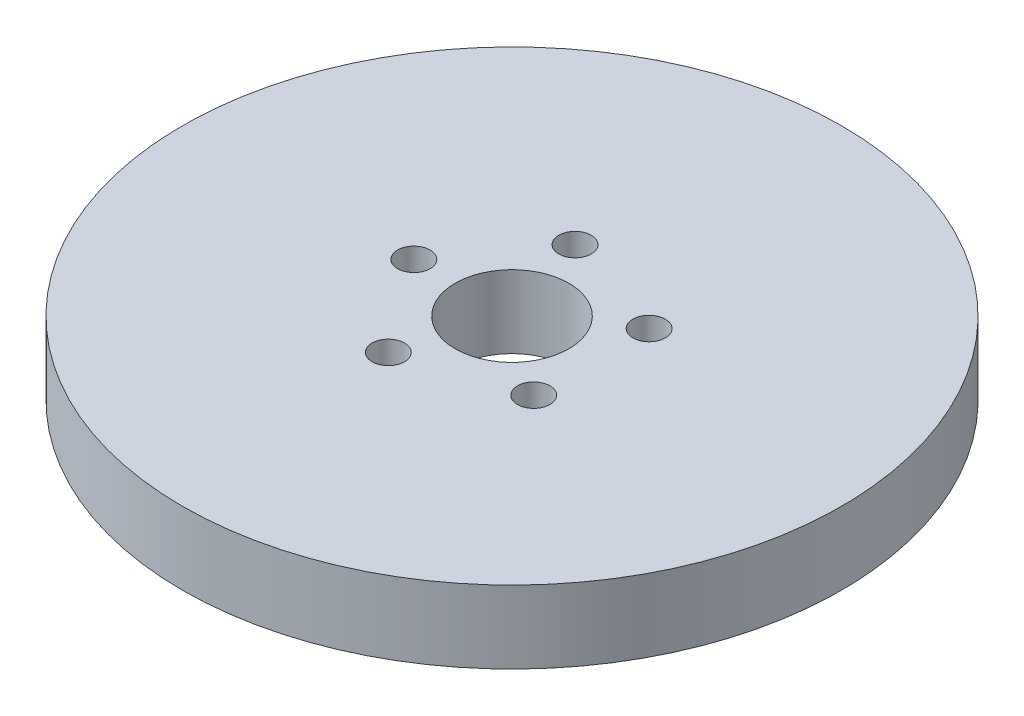
ISO-10303-21;
HEADER;
FILE_DESCRIPTION(('STEP AP214'),'2;1');
FILE_NAME('part.step','',(''),(''),'','','');
FILE_SCHEMA(('AUTOMOTIVE_DESIGN { 1 0 10303 214 1 1 1 1 }'));
ENDSEC;
DATA;
#1=APPLICATION_CONTEXT('core data for automotive mechanical design processes');
#2=APPLICATION_PROTOCOL_DEFINITION('international standard','automotive_design',2000,#1);
#3=PRODUCT_CONTEXT('',#1,'mechanical');
#4=PRODUCT('Part','Part','',(#3));
#5=PRODUCT_RELATED_PRODUCT_CATEGORY('part','',(#4));
#6=PRODUCT_DEFINITION_FORMATION('','',#4);
#7=PRODUCT_DEFINITION_CONTEXT('part definition',#1,'design');
#8=PRODUCT_DEFINITION('design','',#6,#7);
#9=PRODUCT_DEFINITION_SHAPE('','',#8);
#10=(LENGTH_UNIT() NAMED_UNIT(*) SI_UNIT(.MILLI.,.METRE.));
#11=(NAMED_UNIT(*) PLANE_ANGLE_UNIT() SI_UNIT($,.RADIAN.));
#12=(NAMED_UNIT(*) SI_UNIT($,.STERADIAN.) SOLID_ANGLE_UNIT());
#13=UNCERTAINTY_MEASURE_WITH_UNIT(LENGTH_MEASURE(1.E-05),#10,'distance_accuracy_value','');
#14=(GEOMETRIC_REPRESENTATION_CONTEXT(3) GLOBAL_UNCERTAINTY_ASSIGNED_CONTEXT((#13)) GLOBAL_UNIT_ASSIGNED_CONTEXT((#10,
#11,#12)) REPRESENTATION_CONTEXT('',''));
#15=CARTESIAN_POINT('',(0.,0.,0.));
#16=DIRECTION('',(0.,0.,1.));
#17=DIRECTION('',(1.,0.,0.));
#18=AXIS2_PLACEMENT_3D('',#15,#16,#17);
#19=CARTESIAN_POINT('',(0.,16.,0.));
#20=DIRECTION('',(0.,-1.,0.));
#21=DIRECTION('',(0.,0.,-1.));
#22=AXIS2_PLACEMENT_3D('',#19,#20,#21);
#23=CYLINDRICAL_SURFACE('',#22,72.5);
#24=CARTESIAN_POINT('',(0.,16.,0.));
#25=DIRECTION('',(0.,1.,0.));
#26=DIRECTION('',(0.,0.,1.));
#27=AXIS2_PLACEMENT_3D('',#24,#25,#26);
#28=CIRCLE('',#27,72.5);
#29=CARTESIAN_POINT('',(0.,16.,72.5));
#30=VERTEX_POINT('',#29);
#31=EDGE_CURVE('E10',#30,#30,#28,.T.);
#32=ORIENTED_EDGE('',*,*,#31,.F.);
#33=EDGE_LOOP('',(#32));
#34=FACE_BOUND('',#33,.T.);
#35=CARTESIAN_POINT('',(0.,0.,0.));
#36=DIRECTION('',(0.,1.,0.));
#37=DIRECTION('',(0.,0.,1.));
#38=AXIS2_PLACEMENT_3D('',#35,#36,#37);
#39=CIRCLE('',#38,72.5);
#40=CARTESIAN_POINT('',(0.,0.,72.5));
#41=VERTEX_POINT('',#40);
#42=EDGE_CURVE('E37',#41,#41,#39,.T.);
#43=ORIENTED_EDGE('',*,*,#42,.T.);
#44=EDGE_LOOP('',(#43));
#45=FACE_BOUND('',#44,.T.);
#46=ADVANCED_FACE('F40',(#34,#45),#23,.T.);
#47=CARTESIAN_POINT('',(0.,16.,0.));
#48=DIRECTION('',(0.,1.,0.));
#49=DIRECTION('',(0.,0.,1.));
#50=AXIS2_PLACEMENT_3D('',#47,#48,#49);
#51=PLANE('',#50);
#52=CARTESIAN_POINT('',(-6.67213473455149,16.,20.5347192303445));
#53=DIRECTION('',(0.,1.,0.));
#54=DIRECTION('',(0.951056516295155,0.,0.309016994374945));
#55=AXIS2_PLACEMENT_3D('',#52,#53,#54);
#56=CIRCLE('',#55,3.5720443026516);
#57=CARTESIAN_POINT('',(-3.2749187240197,16.,21.638541624524));
#58=VERTEX_POINT('',#57);
#59=EDGE_CURVE('E78',#58,#58,#56,.T.);
#60=ORIENTED_EDGE('',*,*,#59,.F.);
#61=EDGE_LOOP('',(#60));
#62=FACE_BOUND('',#61,.T.);
#63=CARTESIAN_POINT('',(17.4678755125748,16.,12.6911544337889));
#64=DIRECTION('',(0.,1.,0.));
#65=DIRECTION('',(0.587785252292469,0.,-0.809016994374951));
#66=AXIS2_PLACEMENT_3D('',#63,#64,#65);
#67=CIRCLE('',#66,3.5720443026516);
#68=CARTESIAN_POINT('',(19.5674704742087,16.,9.80130988828349));
#69=VERTEX_POINT('',#68);
#70=EDGE_CURVE('E71',#69,#69,#67,.T.);
#71=ORIENTED_EDGE('',*,*,#70,.F.);
#72=EDGE_LOOP('',(#71));
#73=FACE_BOUND('',#72,.T.);
#74=CARTESIAN_POINT('',(17.4678755125746,16.,-12.6911544337891));
#75=DIRECTION('',(0.,1.,0.));
#76=DIRECTION('',(-0.58778525229248,0.,-0.809016994374942));
#77=AXIS2_PLACEMENT_3D('',#74,#75,#76);
#78=CIRCLE('',#77,3.5720443026516);
#79=CARTESIAN_POINT('',(15.3682805509406,16.,-15.5809989792944));
#80=VERTEX_POINT('',#79);
#81=EDGE_CURVE('E70',#80,#80,#78,.T.);
#82=ORIENTED_EDGE('',*,*,#81,.F.);
#83=EDGE_LOOP('',(#82));
#84=FACE_BOUND('',#83,.T.);
#85=CARTESIAN_POINT('',(-6.67213473455177,16.,-20.5347192303444));
#86=DIRECTION('',(0.,1.,0.));
#87=DIRECTION('',(-0.95105651629515,0.,0.309016994374958));
#88=AXIS2_PLACEMENT_3D('',#85,#86,#87);
#89=CIRCLE('',#88,3.5720443026516);
#90=CARTESIAN_POINT('',(-10.0693507450835,16.,-19.4308968361648));
#91=VERTEX_POINT('',#90);
#92=EDGE_CURVE('E61',#91,#91,#89,.T.);
#93=ORIENTED_EDGE('',*,*,#92,.F.);
#94=EDGE_LOOP('',(#93));
#95=FACE_BOUND('',#94,.T.);
#96=CARTESIAN_POINT('',(-21.5914815560463,16.,0.));
#97=DIRECTION('',(0.,1.,0.));
#98=DIRECTION('',(0.,0.,1.));
#99=AXIS2_PLACEMENT_3D('',#96,#97,#98);
#100=CIRCLE('',#99,3.5720443026516);
#101=CARTESIAN_POINT('',(-21.5914815560463,16.,3.5720443026516));
#102=VERTEX_POINT('',#101);
#103=EDGE_CURVE('E54',#102,#102,#100,.T.);
#104=ORIENTED_EDGE('',*,*,#103,.F.);
#105=EDGE_LOOP('',(#104));
#106=FACE_BOUND('',#105,.T.);
#107=CARTESIAN_POINT('',(0.,16.,0.));
#108=DIRECTION('',(0.,1.,0.));
#109=DIRECTION('',(0.,0.,1.));
#110=AXIS2_PLACEMENT_3D('',#107,#108,#109);
#111=CIRCLE('',#110,12.5);
#112=CARTESIAN_POINT('',(0.,16.,12.5));
#113=VERTEX_POINT('',#112);
#114=EDGE_CURVE('E50',#113,#113,#111,.T.);
#115=ORIENTED_EDGE('',*,*,#114,.F.);
#116=EDGE_LOOP('',(#115));
#117=FACE_BOUND('',#116,.T.);
#118=ORIENTED_EDGE('',*,*,#31,.T.);
#119=EDGE_LOOP('',(#118));
#120=FACE_BOUND('',#119,.T.);
#121=ADVANCED_FACE('F94',(#62,#73,#84,#95,#106,#117,#120),#51,.T.);
#122=CARTESIAN_POINT('',(0.,0.,0.));
#123=DIRECTION('',(0.,1.,0.));
#124=DIRECTION('',(0.,0.,1.));
#125=AXIS2_PLACEMENT_3D('',#122,#123,#124);
#126=PLANE('',#125);
#127=CARTESIAN_POINT('',(0.,0.,0.));
#128=DIRECTION('',(0.,1.,0.));
#129=DIRECTION('',(0.,0.,1.));
#130=AXIS2_PLACEMENT_3D('',#127,#128,#129);
#131=CIRCLE('',#130,12.5);
#132=CARTESIAN_POINT('',(0.,0.,12.5));
#133=VERTEX_POINT('',#132);
#134=EDGE_CURVE('E47',#133,#133,#131,.T.);
#135=ORIENTED_EDGE('',*,*,#134,.T.);
#136=EDGE_LOOP('',(#135));
#137=FACE_BOUND('',#136,.T.);
#138=ORIENTED_EDGE('',*,*,#42,.F.);
#139=EDGE_LOOP('',(#138));
#140=FACE_BOUND('',#139,.T.);
#141=ADVANCED_FACE('F100',(#137,#140),#126,.F.);
#142=CARTESIAN_POINT('',(0.,16.,0.));
#143=DIRECTION('',(0.,-1.,0.));
#144=DIRECTION('',(0.,0.,-1.));
#145=AXIS2_PLACEMENT_3D('',#142,#143,#144);
#146=CYLINDRICAL_SURFACE('',#145,12.5);
#147=ORIENTED_EDGE('',*,*,#114,.T.);
#148=EDGE_LOOP('',(#147));
#149=FACE_BOUND('',#148,.T.);
#150=ORIENTED_EDGE('',*,*,#134,.F.);
#151=EDGE_LOOP('',(#150));
#152=FACE_BOUND('',#151,.T.);
#153=ADVANCED_FACE('F108',(#149,#152),#146,.F.);
#154=CARTESIAN_POINT('',(-21.5914815560463,2.07136651765874,0.));
#155=DIRECTION('',(0.,1.,0.));
#156=DIRECTION('',(0.,0.,1.));
#157=AXIS2_PLACEMENT_3D('',#154,#155,#156);
#158=CYLINDRICAL_SURFACE('',#157,3.5720443026516);
#159=CARTESIAN_POINT('',(-21.5914815560463,2.07136651765874,0.));
#160=DIRECTION('',(0.,1.,0.));
#161=DIRECTION('',(0.,0.,1.));
#162=AXIS2_PLACEMENT_3D('',#159,#160,#161);
#163=CIRCLE('',#162,3.5720443026516);
#164=CARTESIAN_POINT('',(-21.5914815560463,2.07136651765874,3.5720443026516));
#165=VERTEX_POINT('',#164);
#166=EDGE_CURVE('E55',#165,#165,#163,.T.);
#167=ORIENTED_EDGE('',*,*,#166,.F.);
#168=EDGE_LOOP('',(#167));
#169=FACE_BOUND('',#168,.T.);
#170=ORIENTED_EDGE('',*,*,#103,.T.);
#171=EDGE_LOOP('',(#170));
#172=FACE_BOUND('',#171,.T.);
#173=ADVANCED_FACE('F115',(#169,#172),#158,.F.);
#174=CARTESIAN_POINT('',(-21.5914815560463,2.07136651765874,0.));
#175=DIRECTION('',(0.,1.,0.));
#176=DIRECTION('',(0.,0.,1.));
#177=AXIS2_PLACEMENT_3D('',#174,#175,#176);
#178=PLANE('',#177);
#179=ORIENTED_EDGE('',*,*,#166,.T.);
#180=EDGE_LOOP('',(#179));
#181=FACE_BOUND('',#180,.T.);
#182=ADVANCED_FACE('F142',(#181),#178,.T.);
#183=CARTESIAN_POINT('',(-6.67213473455177,2.07136651765874,-20.5347192303444));
#184=DIRECTION('',(0.,1.,0.));
#185=DIRECTION('',(0.,0.,1.));
#186=AXIS2_PLACEMENT_3D('',#183,#184,#185);
#187=CYLINDRICAL_SURFACE('',#186,3.5720443026516);
#188=CARTESIAN_POINT('',(-6.67213473455177,2.07136651765874,-20.5347192303444));
#189=DIRECTION('',(0.,1.,0.));
#190=DIRECTION('',(-0.95105651629515,0.,0.309016994374958));
#191=AXIS2_PLACEMENT_3D('',#188,#189,#190);
#192=CIRCLE('',#191,3.5720443026516);
#193=CARTESIAN_POINT('',(-10.0693507450835,2.07136651765874,-19.4308968361648));
#194=VERTEX_POINT('',#193);
#195=EDGE_CURVE('E63',#194,#194,#192,.T.);
#196=ORIENTED_EDGE('',*,*,#195,.F.);
#197=EDGE_LOOP('',(#196));
#198=FACE_BOUND('',#197,.T.);
#199=ORIENTED_EDGE('',*,*,#92,.T.);
#200=EDGE_LOOP('',(#199));
#201=FACE_BOUND('',#200,.T.);
#202=ADVANCED_FACE('F147',(#198,#201),#187,.F.);
#203=CARTESIAN_POINT('',(-6.67213473455177,2.07136651765874,-20.5347192303444));
#204=DIRECTION('',(0.,1.,0.));
#205=DIRECTION('',(-0.95105651629515,0.,0.309016994374958));
#206=AXIS2_PLACEMENT_3D('',#203,#204,#205);
#207=PLANE('',#206);
#208=ORIENTED_EDGE('',*,*,#195,.T.);
#209=EDGE_LOOP('',(#208));
#210=FACE_BOUND('',#209,.T.);
#211=ADVANCED_FACE('F163',(#210),#207,.T.);
#212=CARTESIAN_POINT('',(17.4678755125746,2.07136651765874,-12.6911544337891));
#213=DIRECTION('',(0.,1.,0.));
#214=DIRECTION('',(0.,0.,1.));
#215=AXIS2_PLACEMENT_3D('',#212,#213,#214);
#216=CYLINDRICAL_SURFACE('',#215,3.5720443026516);
#217=CARTESIAN_POINT('',(17.4678755125746,2.07136651765874,-12.6911544337891));
#218=DIRECTION('',(0.,1.,0.));
#219=DIRECTION('',(-0.58778525229248,0.,-0.809016994374942));
#220=AXIS2_PLACEMENT_3D('',#217,#218,#219);
#221=CIRCLE('',#220,3.5720443026516);
#222=CARTESIAN_POINT('',(15.3682805509406,2.07136651765874,-15.5809989792944));
#223=VERTEX_POINT('',#222);
#224=EDGE_CURVE('E69',#223,#223,#221,.T.);
#225=ORIENTED_EDGE('',*,*,#224,.F.);
#226=EDGE_LOOP('',(#225));
#227=FACE_BOUND('',#226,.T.);
#228=ORIENTED_EDGE('',*,*,#81,.T.);
#229=EDGE_LOOP('',(#228));
#230=FACE_BOUND('',#229,.T.);
#231=ADVANCED_FACE('F172',(#227,#230),#216,.F.);
#232=CARTESIAN_POINT('',(17.4678755125746,2.07136651765874,-12.6911544337891));
#233=DIRECTION('',(0.,1.,0.));
#234=DIRECTION('',(-0.58778525229248,0.,-0.809016994374942));
#235=AXIS2_PLACEMENT_3D('',#232,#233,#234);
#236=PLANE('',#235);
#237=ORIENTED_EDGE('',*,*,#224,.T.);
#238=EDGE_LOOP('',(#237));
#239=FACE_BOUND('',#238,.T.);
#240=ADVANCED_FACE('F185',(#239),#236,.T.);
#241=CARTESIAN_POINT('',(17.4678755125748,2.07136651765874,12.6911544337889));
#242=DIRECTION('',(0.,1.,0.));
#243=DIRECTION('',(0.,0.,1.));
#244=AXIS2_PLACEMENT_3D('',#241,#242,#243);
#245=CYLINDRICAL_SURFACE('',#244,3.5720443026516);
#246=CARTESIAN_POINT('',(17.4678755125748,2.07136651765874,12.6911544337889));
#247=DIRECTION('',(0.,1.,0.));
#248=DIRECTION('',(0.587785252292469,0.,-0.809016994374951));
#249=AXIS2_PLACEMENT_3D('',#246,#247,#248);
#250=CIRCLE('',#249,3.5720443026516);
#251=CARTESIAN_POINT('',(19.5674704742087,2.07136651765874,9.80130988828349));
#252=VERTEX_POINT('',#251);
#253=EDGE_CURVE('E76',#252,#252,#250,.T.);
#254=ORIENTED_EDGE('',*,*,#253,.F.);
#255=EDGE_LOOP('',(#254));
#256=FACE_BOUND('',#255,.T.);
#257=ORIENTED_EDGE('',*,*,#70,.T.);
#258=EDGE_LOOP('',(#257));
#259=FACE_BOUND('',#258,.T.);
#260=ADVANCED_FACE('F191',(#256,#259),#245,.F.);
#261=CARTESIAN_POINT('',(17.4678755125748,2.07136651765874,12.6911544337889));
#262=DIRECTION('',(0.,1.,0.));
#263=DIRECTION('',(0.587785252292469,0.,-0.809016994374951));
#264=AXIS2_PLACEMENT_3D('',#261,#262,#263);
#265=PLANE('',#264);
#266=ORIENTED_EDGE('',*,*,#253,.T.);
#267=EDGE_LOOP('',(#266));
#268=FACE_BOUND('',#267,.T.);
#269=ADVANCED_FACE('F89',(#268),#265,.T.);
#270=CARTESIAN_POINT('',(-6.67213473455149,2.07136651765874,20.5347192303445));
#271=DIRECTION('',(0.,1.,0.));
#272=DIRECTION('',(0.,0.,1.));
#273=AXIS2_PLACEMENT_3D('',#270,#271,#272);
#274=CYLINDRICAL_SURFACE('',#273,3.5720443026516);
#275=CARTESIAN_POINT('',(-6.67213473455149,2.07136651765874,20.5347192303445));
#276=DIRECTION('',(0.,1.,0.));
#277=DIRECTION('',(0.951056516295155,0.,0.309016994374945));
#278=AXIS2_PLACEMENT_3D('',#275,#276,#277);
#279=CIRCLE('',#278,3.5720443026516);
#280=CARTESIAN_POINT('',(-3.2749187240197,2.07136651765874,21.638541624524));
#281=VERTEX_POINT('',#280);
#282=EDGE_CURVE('E59',#281,#281,#279,.T.);
#283=ORIENTED_EDGE('',*,*,#282,.F.);
#284=EDGE_LOOP('',(#283));
#285=FACE_BOUND('',#284,.T.);
#286=ORIENTED_EDGE('',*,*,#59,.T.);
#287=EDGE_LOOP('',(#286));
#288=FACE_BOUND('',#287,.T.);
#289=ADVANCED_FACE('F87',(#285,#288),#274,.F.);
#290=CARTESIAN_POINT('',(-6.67213473455149,2.07136651765874,20.5347192303445));
#291=DIRECTION('',(0.,1.,0.));
#292=DIRECTION('',(0.951056516295155,0.,0.309016994374945));
#293=AXIS2_PLACEMENT_3D('',#290,#291,#292);
#294=PLANE('',#293);
#295=ORIENTED_EDGE('',*,*,#282,.T.);
#296=EDGE_LOOP('',(#295));
#297=FACE_BOUND('',#296,.T.);
#298=ADVANCED_FACE('F84',(#297),#294,.T.);
#299=CLOSED_SHELL('',(#46,#121,#141,#153,#173,#182,#202,#211,#231,#240,#260,#269,#289,#298));
#300=MANIFOLD_SOLID_BREP('B2',#299);
#301=ADVANCED_BREP_SHAPE_REPRESENTATION('',(#18,#300),#14);
#302=SHAPE_DEFINITION_REPRESENTATION(#9,#301);
ENDSEC;
END-ISO-10303-21;
